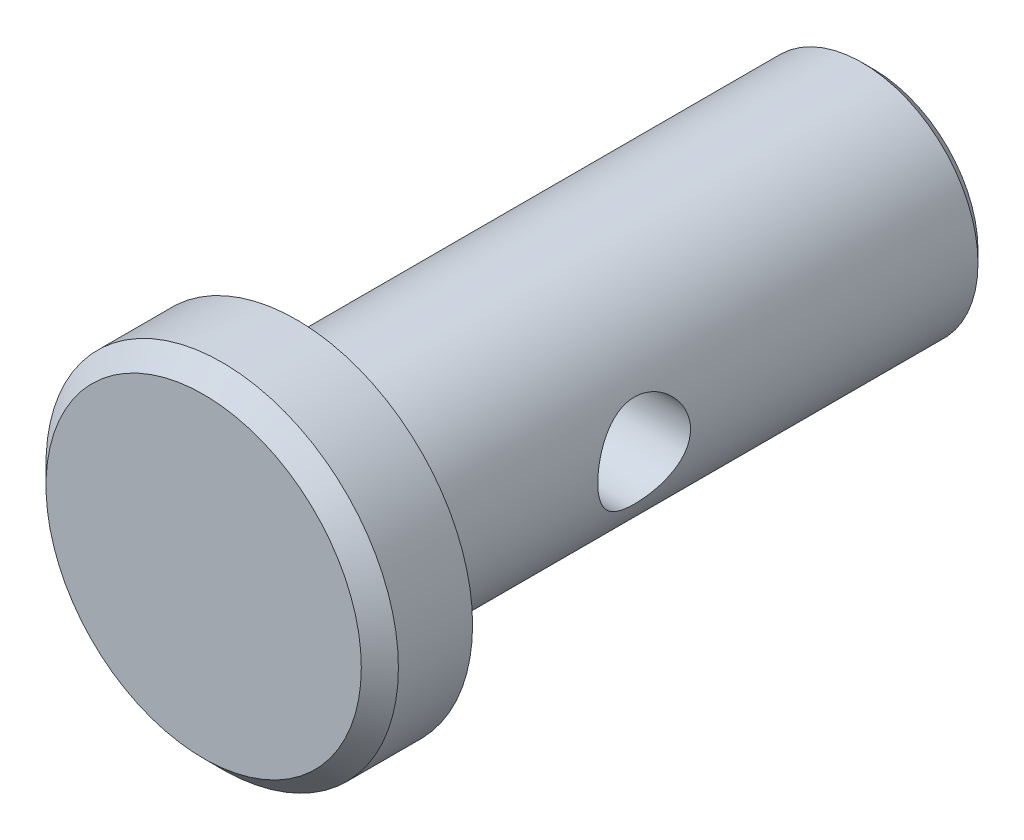
ISO-10303-21;
HEADER;
FILE_DESCRIPTION(('STEP AP214'),'2;1');
FILE_NAME('part.step','',(''),(''),'','','');
FILE_SCHEMA(('AUTOMOTIVE_DESIGN { 1 0 10303 214 1 1 1 1 }'));
ENDSEC;
DATA;
#1=APPLICATION_CONTEXT('core data for automotive mechanical design processes');
#2=APPLICATION_PROTOCOL_DEFINITION('international standard','automotive_design',2000,#1);
#3=PRODUCT_CONTEXT('',#1,'mechanical');
#4=PRODUCT('Part','Part','',(#3));
#5=PRODUCT_RELATED_PRODUCT_CATEGORY('part','',(#4));
#6=PRODUCT_DEFINITION_FORMATION('','',#4);
#7=PRODUCT_DEFINITION_CONTEXT('part definition',#1,'design');
#8=PRODUCT_DEFINITION('design','',#6,#7);
#9=PRODUCT_DEFINITION_SHAPE('','',#8);
#10=(LENGTH_UNIT() NAMED_UNIT(*) SI_UNIT(.MILLI.,.METRE.));
#11=(NAMED_UNIT(*) PLANE_ANGLE_UNIT() SI_UNIT($,.RADIAN.));
#12=(NAMED_UNIT(*) SI_UNIT($,.STERADIAN.) SOLID_ANGLE_UNIT());
#13=UNCERTAINTY_MEASURE_WITH_UNIT(LENGTH_MEASURE(1.E-05),#10,'distance_accuracy_value','');
#14=(GEOMETRIC_REPRESENTATION_CONTEXT(3) GLOBAL_UNCERTAINTY_ASSIGNED_CONTEXT((#13)) GLOBAL_UNIT_ASSIGNED_CONTEXT((#10,
#11,#12)) REPRESENTATION_CONTEXT('',''));
#15=CARTESIAN_POINT('',(0.,0.,0.));
#16=DIRECTION('',(0.,0.,1.));
#17=DIRECTION('',(1.,0.,0.));
#18=AXIS2_PLACEMENT_3D('',#15,#16,#17);
#19=CARTESIAN_POINT('',(0.,0.,-1.524));
#20=DIRECTION('',(0.,0.,1.));
#21=DIRECTION('',(1.,0.,0.));
#22=AXIS2_PLACEMENT_3D('',#19,#20,#21);
#23=CYLINDRICAL_SURFACE('',#22,3.175);
#24=CARTESIAN_POINT('',(0.,0.,-1.20649999999999));
#25=DIRECTION('',(0.,0.,1.));
#26=DIRECTION('',(1.,0.,0.));
#27=AXIS2_PLACEMENT_3D('',#24,#25,#26);
#28=CIRCLE('',#27,3.175);
#29=CARTESIAN_POINT('',(3.175,0.,-1.20649999999999));
#30=VERTEX_POINT('',#29);
#31=EDGE_CURVE('E50',#30,#30,#28,.T.);
#32=ORIENTED_EDGE('',*,*,#31,.T.);
#33=EDGE_LOOP('',(#32));
#34=FACE_BOUND('',#33,.T.);
#35=CARTESIAN_POINT('',(0.,0.,14.2875));
#36=DIRECTION('',(0.,0.,1.));
#37=DIRECTION('',(1.,0.,0.));
#38=AXIS2_PLACEMENT_3D('',#35,#36,#37);
#39=CIRCLE('',#38,3.175);
#40=CARTESIAN_POINT('',(3.175,0.,14.2875));
#41=VERTEX_POINT('',#40);
#42=EDGE_CURVE('E95',#41,#41,#39,.T.);
#43=ORIENTED_EDGE('',*,*,#42,.F.);
#44=EDGE_LOOP('',(#43));
#45=FACE_BOUND('',#44,.T.);
#46=CARTESIAN_POINT('',(-3.175,0.,9.2075));
#47=CARTESIAN_POINT('',(-3.17499537229199,-0.068258058456236,9.20749374409193));
#48=CARTESIAN_POINT('',(-3.17277301884902,-0.136634578197578,9.20196422742388));
#49=CARTESIAN_POINT('',(-3.16409992718907,-0.271460265065364,9.18003770826401));
#50=CARTESIAN_POINT('',(-3.15763769473787,-0.337903678751393,9.16361116278031));
#51=CARTESIAN_POINT('',(-3.1411812285033,-0.466695740931901,9.12058369043264));
#52=CARTESIAN_POINT('',(-3.13119856591186,-0.529057020126769,9.09401607265238));
#53=CARTESIAN_POINT('',(-3.1086844785551,-0.648380701158513,9.03159282493764));
#54=CARTESIAN_POINT('',(-3.09615393885866,-0.70534496773688,8.99574041912648));
#55=CARTESIAN_POINT('',(-3.06915112718216,-0.8150231398072,8.91398045841381));
#56=CARTESIAN_POINT('',(-3.05461858550036,-0.867449543069386,8.86770727328743));
#57=CARTESIAN_POINT('',(-3.02552466335433,-0.964041128038299,8.76719099779225));
#58=CARTESIAN_POINT('',(-3.01096327228158,-1.00820226802979,8.71294403127055));
#59=CARTESIAN_POINT('',(-2.98273972791182,-1.08894535023098,8.59508817539616));
#60=CARTESIAN_POINT('',(-2.96914643637744,-1.12510251305913,8.53117008137527));
#61=CARTESIAN_POINT('',(-2.94534365963613,-1.18602424658859,8.39753438700327));
#62=CARTESIAN_POINT('',(-2.93513256790052,-1.2107942283215,8.32781955981629));
#63=CARTESIAN_POINT('',(-2.9198973711462,-1.24707575285638,8.18787266816902));
#64=CARTESIAN_POINT('',(-2.91465901925809,-1.25913766828659,8.11780746540911));
#65=CARTESIAN_POINT('',(-2.90934142571206,-1.27137983064142,7.97646677607489));
#66=CARTESIAN_POINT('',(-2.90925964706958,-1.2715659203589,7.90519190191312));
#67=CARTESIAN_POINT('',(-2.91408167677796,-1.26046824836539,7.76874451362414));
#68=CARTESIAN_POINT('',(-2.91863891149416,-1.24998182458376,7.70349252135026));
#69=CARTESIAN_POINT('',(-2.93164379130976,-1.21916626898912,7.57576618193574));
#70=CARTESIAN_POINT('',(-2.94009211524262,-1.19883541970094,7.51329232154995));
#71=CARTESIAN_POINT('',(-2.96011273031217,-1.14852115516993,7.39138867401551));
#72=CARTESIAN_POINT('',(-2.971745258433,-1.11834921257023,7.33204703320027));
#73=CARTESIAN_POINT('',(-2.9968070390758,-1.04934160256496,7.21905095661041));
#74=CARTESIAN_POINT('',(-3.01023696565099,-1.01050268123904,7.16539866802922));
#75=CARTESIAN_POINT('',(-3.03864477831342,-0.921734630653566,7.06093982221073));
#76=CARTESIAN_POINT('',(-3.05366207259856,-0.871180288986354,7.01067385680178));
#77=CARTESIAN_POINT('',(-3.08266988848509,-0.762199661418173,6.9191603564687));
#78=CARTESIAN_POINT('',(-3.09666020522781,-0.703771811487366,6.87791461764446));
#79=CARTESIAN_POINT('',(-3.12238822602988,-0.57916930940471,6.80490292089095));
#80=CARTESIAN_POINT('',(-3.13407596510588,-0.512864412005013,6.77334035143987));
#81=CARTESIAN_POINT('',(-3.15350415988762,-0.37530009108163,6.72200340821543));
#82=CARTESIAN_POINT('',(-3.16124662048613,-0.304043204999543,6.70222304615104));
#83=CARTESIAN_POINT('',(-3.17154648586888,-0.163128888630966,6.67610533240849));
#84=CARTESIAN_POINT('',(-3.17438370604281,-0.0936264916808149,6.66904149154899));
#85=CARTESIAN_POINT('',(-3.17543483854251,0.0456217717279636,6.66641218116433));
#86=CARTESIAN_POINT('',(-3.17364994924755,0.115367570397191,6.67084373121733));
#87=CARTESIAN_POINT('',(-3.16584055085483,0.249829789342462,6.69054526287051));
#88=CARTESIAN_POINT('',(-3.16001013504407,0.314631382277426,6.70531931752287));
#89=CARTESIAN_POINT('',(-3.14489745292492,0.440775996818595,6.74461167477673));
#90=CARTESIAN_POINT('',(-3.13561474321397,0.502118572992776,6.76913122908961));
#91=CARTESIAN_POINT('',(-3.11414537679465,0.621715028993606,6.82801843669677));
#92=CARTESIAN_POINT('',(-3.10187858147175,0.679817044449683,6.8626643747474));
#93=CARTESIAN_POINT('',(-3.07577086613408,0.789586680441563,6.94051210568008));
#94=CARTESIAN_POINT('',(-3.06192931625022,0.841251708883315,6.98371732725586));
#95=CARTESIAN_POINT('',(-3.03304649700201,0.9402591323233,7.08080245822301));
#96=CARTESIAN_POINT('',(-3.01798635304908,0.987090947966851,7.13519879885644));
#97=CARTESIAN_POINT('',(-2.98920962302379,1.07108701035771,7.25134445271095));
#98=CARTESIAN_POINT('',(-2.97549325859334,1.10824966394932,7.31309497521587));
#99=CARTESIAN_POINT('',(-2.95093580441395,1.17208776372658,7.44312817606726));
#100=CARTESIAN_POINT('',(-2.9401238561184,1.19865812752938,7.51146833949982));
#101=CARTESIAN_POINT('',(-2.92305532658486,1.23970809951287,7.65221586883912));
#102=CARTESIAN_POINT('',(-2.91679538366959,1.25419663134602,7.72462019069089));
#103=CARTESIAN_POINT('',(-2.91002567155453,1.26981941697178,7.86582621762683));
#104=CARTESIAN_POINT('',(-2.90913452340189,1.27183964726232,7.93451222314178));
#105=CARTESIAN_POINT('',(-2.91220420881017,1.26479500614123,8.07119598464794));
#106=CARTESIAN_POINT('',(-2.91616442626244,1.25573154232525,8.13919382692814));
#107=CARTESIAN_POINT('',(-2.92815422165178,1.22750031750757,8.26981594055795));
#108=CARTESIAN_POINT('',(-2.9360166821043,1.20874630841757,8.33254637426496));
#109=CARTESIAN_POINT('',(-2.95480740782762,1.16205345979179,8.45399542980456));
#110=CARTESIAN_POINT('',(-2.96573651965814,1.13411208368507,8.51271293828139));
#111=CARTESIAN_POINT('',(-2.99020617098852,1.06798920435243,8.62813210823695));
#112=CARTESIAN_POINT('',(-3.00386040268909,1.02931298782628,8.68452585553286));
#113=CARTESIAN_POINT('',(-3.03189515776371,0.9435414957374,8.79030075642439));
#114=CARTESIAN_POINT('',(-3.04627589910738,0.896443682609507,8.83967978830148));
#115=CARTESIAN_POINT('',(-3.07526415100495,0.791530996483014,8.93330881182239));
#116=CARTESIAN_POINT('',(-3.08982591305988,0.733219260727799,8.97701868988027));
#117=CARTESIAN_POINT('',(-3.1165825826321,0.609536703381471,9.05404402206474));
#118=CARTESIAN_POINT('',(-3.12877638843995,0.544162617887497,9.08735464221686));
#119=CARTESIAN_POINT('',(-3.14921718908072,0.409408669684454,9.14185510664583));
#120=CARTESIAN_POINT('',(-3.15753345539943,0.340126077569507,9.16325912046081));
#121=CARTESIAN_POINT('',(-3.16956634442947,0.198676606888576,9.19393584180596));
#122=CARTESIAN_POINT('',(-3.1732975617973,0.12651963892041,9.20324704733238));
#123=CARTESIAN_POINT('',(-3.17484696185127,0.0361393091607406,9.2071160669212));
#124=CARTESIAN_POINT('',(-3.17500122535427,0.0180738073503817,9.20750165647954));
#125=CARTESIAN_POINT('',(-3.175,0.,9.2075));
#126=B_SPLINE_CURVE_WITH_KNOTS('',3,(#46,#47,#48,#49,#50,#51,#52,#53,#54,#55,#56,#57,#58,#59,
#60,#61,#62,#63,#64,#65,#66,#67,#68,#69,#70,#71,#72,#73,#74,#75,#76,#77,#78,#79,#80,#81,#82,#83,
#84,#85,#86,#87,#88,#89,#90,#91,#92,#93,#94,#95,#96,#97,#98,#99,#100,#101,#102,#103,#104,#105,
#106,#107,#108,#109,#110,#111,#112,#113,#114,#115,#116,#117,#118,#119,#120,#121,#122,#123,#124,
#125),.UNSPECIFIED.,.T.,.F.,(4,2,2,2,2,2,2,2,2,2,2,2,2,2,2,2,2,2,2,2,2,2,2,2,2,2,2,2,2,2,2,2,2,
2,2,2,2,2,2,4),(0.,0.2047258973121,0.410009108865038,0.614623775494454,0.8191674851567,
1.03249337379752,1.24592330783351,1.46885189350203,1.691674436801,1.90439106871106,
2.1170030452621,2.31481838534871,2.5126682490759,2.71455595199748,2.91651957930746,
3.13409551733464,3.3517147395323,3.57363339858382,3.79543917132257,4.00411432175285,
4.21273537417002,4.41198289283372,4.61125601111061,4.81662431007897,5.02207504281845,
5.24108981386503,5.4601406484278,5.68131353664426,5.90232292130168,6.10742792604395,
6.31250688577534,6.50947592278469,6.70649938736278,6.91480372216,7.1231709285623,
7.34504768943986,7.56702743411739,7.78487331143458,8.00202395276757,8.05623259144465),.UNSPECIFIED.);
#127=CARTESIAN_POINT('',(-3.175,0.,9.2075));
#128=VERTEX_POINT('',#127);
#129=EDGE_CURVE('E42',#128,#128,#126,.T.);
#130=ORIENTED_EDGE('',*,*,#129,.T.);
#131=EDGE_LOOP('',(#130));
#132=FACE_BOUND('',#131,.T.);
#133=CARTESIAN_POINT('',(3.175,0.,9.2075));
#134=CARTESIAN_POINT('',(3.17499537229199,0.0682580584562361,9.20749374409193));
#135=CARTESIAN_POINT('',(3.17277301884902,0.136634578197578,9.20196422742388));
#136=CARTESIAN_POINT('',(3.16409992718907,0.271460265065364,9.18003770826401));
#137=CARTESIAN_POINT('',(3.15763769473787,0.337903678751393,9.16361116278031));
#138=CARTESIAN_POINT('',(3.1411812285033,0.466695740931902,9.12058369043264));
#139=CARTESIAN_POINT('',(3.13119856591186,0.52905702012677,9.09401607265238));
#140=CARTESIAN_POINT('',(3.10868447855509,0.648380701158514,9.03159282493764));
#141=CARTESIAN_POINT('',(3.09615393885866,0.70534496773688,8.99574041912648));
#142=CARTESIAN_POINT('',(3.06915112718216,0.8150231398072,8.91398045841381));
#143=CARTESIAN_POINT('',(3.05461858550036,0.867449543069386,8.86770727328743));
#144=CARTESIAN_POINT('',(3.02552466335433,0.964041128038299,8.76719099779225));
#145=CARTESIAN_POINT('',(3.01096327228158,1.00820226802979,8.71294403127055));
#146=CARTESIAN_POINT('',(2.98273972791182,1.08894535023098,8.59508817539616));
#147=CARTESIAN_POINT('',(2.96914643637744,1.12510251305913,8.53117008137527));
#148=CARTESIAN_POINT('',(2.94534365963613,1.18602424658859,8.39753438700327));
#149=CARTESIAN_POINT('',(2.93513256790052,1.21079422832151,8.32781955981629));
#150=CARTESIAN_POINT('',(2.9198973711462,1.24707575285638,8.18787266816901));
#151=CARTESIAN_POINT('',(2.91465901925809,1.25913766828659,8.1178074654091));
#152=CARTESIAN_POINT('',(2.90934142571206,1.27137983064142,7.97646677607488));
#153=CARTESIAN_POINT('',(2.90925964706958,1.2715659203589,7.90519190191311));
#154=CARTESIAN_POINT('',(2.91408167677796,1.26046824836539,7.76874451362414));
#155=CARTESIAN_POINT('',(2.91863891149416,1.24998182458376,7.70349252135026));
#156=CARTESIAN_POINT('',(2.93164379130976,1.21916626898912,7.57576618193574));
#157=CARTESIAN_POINT('',(2.94009211524262,1.19883541970094,7.51329232154995));
#158=CARTESIAN_POINT('',(2.96011273031217,1.14852115516993,7.39138867401551));
#159=CARTESIAN_POINT('',(2.971745258433,1.11834921257023,7.33204703320027));
#160=CARTESIAN_POINT('',(2.9968070390758,1.04934160256496,7.21905095661041));
#161=CARTESIAN_POINT('',(3.01023696565099,1.01050268123904,7.16539866802922));
#162=CARTESIAN_POINT('',(3.03864477831342,0.921734630653565,7.06093982221073));
#163=CARTESIAN_POINT('',(3.05366207259856,0.871180288986353,7.01067385680178));
#164=CARTESIAN_POINT('',(3.08266988848509,0.762199661418172,6.9191603564687));
#165=CARTESIAN_POINT('',(3.09666020522781,0.703771811487365,6.87791461764446));
#166=CARTESIAN_POINT('',(3.12238822602988,0.57916930940471,6.80490292089095));
#167=CARTESIAN_POINT('',(3.13407596510588,0.512864412005013,6.77334035143987));
#168=CARTESIAN_POINT('',(3.15350415988762,0.37530009108163,6.72200340821543));
#169=CARTESIAN_POINT('',(3.16124662048613,0.304043204999543,6.70222304615104));
#170=CARTESIAN_POINT('',(3.17154648586888,0.163128888630965,6.67610533240849));
#171=CARTESIAN_POINT('',(3.17438370604281,0.0936264916808141,6.66904149154899));
#172=CARTESIAN_POINT('',(3.17543483854251,-0.0456217717279645,6.66641218116433));
#173=CARTESIAN_POINT('',(3.17364994924755,-0.115367570397192,6.67084373121733));
#174=CARTESIAN_POINT('',(3.16584055085483,-0.249829789342463,6.69054526287051));
#175=CARTESIAN_POINT('',(3.16001013504407,-0.314631382277427,6.70531931752287));
#176=CARTESIAN_POINT('',(3.14489745292492,-0.440775996818596,6.74461167477673));
#177=CARTESIAN_POINT('',(3.13561474321397,-0.502118572992777,6.76913122908961));
#178=CARTESIAN_POINT('',(3.11414537679465,-0.621715028993606,6.82801843669677));
#179=CARTESIAN_POINT('',(3.10187858147175,-0.679817044449683,6.8626643747474));
#180=CARTESIAN_POINT('',(3.07577086613408,-0.789586680441563,6.94051210568008));
#181=CARTESIAN_POINT('',(3.06192931625022,-0.841251708883315,6.98371732725586));
#182=CARTESIAN_POINT('',(3.03304649700201,-0.9402591323233,7.08080245822301));
#183=CARTESIAN_POINT('',(3.01798635304908,-0.987090947966851,7.13519879885644));
#184=CARTESIAN_POINT('',(2.98920962302379,-1.07108701035771,7.25134445271095));
#185=CARTESIAN_POINT('',(2.97549325859334,-1.10824966394932,7.31309497521587));
#186=CARTESIAN_POINT('',(2.95093580441395,-1.17208776372658,7.44312817606726));
#187=CARTESIAN_POINT('',(2.9401238561184,-1.19865812752938,7.51146833949982));
#188=CARTESIAN_POINT('',(2.92305532658486,-1.23970809951287,7.65221586883912));
#189=CARTESIAN_POINT('',(2.91679538366959,-1.25419663134602,7.72462019069089));
#190=CARTESIAN_POINT('',(2.91002567155453,-1.26981941697179,7.86582621762684));
#191=CARTESIAN_POINT('',(2.90913452340189,-1.27183964726232,7.93451222314178));
#192=CARTESIAN_POINT('',(2.91220420881017,-1.26479500614123,8.07119598464794));
#193=CARTESIAN_POINT('',(2.91616442626244,-1.25573154232525,8.13919382692814));
#194=CARTESIAN_POINT('',(2.92815422165178,-1.22750031750757,8.26981594055795));
#195=CARTESIAN_POINT('',(2.9360166821043,-1.20874630841757,8.33254637426496));
#196=CARTESIAN_POINT('',(2.95480740782762,-1.16205345979179,8.45399542980456));
#197=CARTESIAN_POINT('',(2.96573651965814,-1.13411208368507,8.51271293828139));
#198=CARTESIAN_POINT('',(2.99020617098852,-1.06798920435243,8.62813210823695));
#199=CARTESIAN_POINT('',(3.00386040268909,-1.02931298782628,8.68452585553286));
#200=CARTESIAN_POINT('',(3.03189515776371,-0.943541495737399,8.79030075642439));
#201=CARTESIAN_POINT('',(3.04627589910738,-0.896443682609506,8.83967978830148));
#202=CARTESIAN_POINT('',(3.07526415100495,-0.791530996483013,8.9333088118224));
#203=CARTESIAN_POINT('',(3.08982591305988,-0.733219260727798,8.97701868988027));
#204=CARTESIAN_POINT('',(3.1165825826321,-0.60953670338147,9.05404402206474));
#205=CARTESIAN_POINT('',(3.12877638843996,-0.544162617887496,9.08735464221686));
#206=CARTESIAN_POINT('',(3.14921718908072,-0.409408669684454,9.14185510664583));
#207=CARTESIAN_POINT('',(3.15753345539943,-0.340126077569507,9.16325912046081));
#208=CARTESIAN_POINT('',(3.16956634442947,-0.198676606888575,9.19393584180596));
#209=CARTESIAN_POINT('',(3.1732975617973,-0.126519638920409,9.20324704733238));
#210=CARTESIAN_POINT('',(3.17484696185127,-0.0361393091607402,9.2071160669212));
#211=CARTESIAN_POINT('',(3.17500122535427,-0.0180738073503815,9.20750165647954));
#212=CARTESIAN_POINT('',(3.175,0.,9.2075));
#213=B_SPLINE_CURVE_WITH_KNOTS('',3,(#133,#134,#135,#136,#137,#138,#139,#140,#141,#142,#143,
#144,#145,#146,#147,#148,#149,#150,#151,#152,#153,#154,#155,#156,#157,#158,#159,#160,#161,#162,
#163,#164,#165,#166,#167,#168,#169,#170,#171,#172,#173,#174,#175,#176,#177,#178,#179,#180,#181,
#182,#183,#184,#185,#186,#187,#188,#189,#190,#191,#192,#193,#194,#195,#196,#197,#198,#199,#200,
#201,#202,#203,#204,#205,#206,#207,#208,#209,#210,#211,#212),.UNSPECIFIED.,.T.,.F.,(4,2,2,2,2,2,
2,2,2,2,2,2,2,2,2,2,2,2,2,2,2,2,2,2,2,2,2,2,2,2,2,2,2,2,2,2,2,2,2,4),(0.,0.2047258973121,
0.410009108865039,0.614623775494455,0.8191674851567,1.03249337379752,1.24592330783351,
1.46885189350203,1.691674436801,1.90439106871106,2.1170030452621,2.31481838534871,
2.5126682490759,2.71455595199748,2.91651957930746,3.13409551733464,3.3517147395323,
3.57363339858382,3.79543917132257,4.00411432175285,4.21273537417002,4.41198289283372,
4.61125601111061,4.81662431007897,5.02207504281845,5.24108981386503,5.4601406484278,
5.68131353664426,5.90232292130168,6.10742792604395,6.31250688577534,6.50947592278469,
6.70649938736278,6.91480372216,7.1231709285623,7.34504768943986,7.56702743411739,
7.78487331143458,8.00202395276758,8.05623259144465),.UNSPECIFIED.);
#214=CARTESIAN_POINT('',(3.175,0.,9.2075));
#215=VERTEX_POINT('',#214);
#216=EDGE_CURVE('E10',#215,#215,#213,.T.);
#217=ORIENTED_EDGE('',*,*,#216,.T.);
#218=EDGE_LOOP('',(#217));
#219=FACE_BOUND('',#218,.T.);
#220=ADVANCED_FACE('F31',(#34,#45,#132,#219),#23,.T.);
#221=CARTESIAN_POINT('',(0.,0.,-1.524));
#222=DIRECTION('',(0.,0.,1.));
#223=DIRECTION('',(1.,0.,0.));
#224=AXIS2_PLACEMENT_3D('',#221,#222,#223);
#225=PLANE('',#224);
#226=CARTESIAN_POINT('',(0.,0.,-1.524));
#227=DIRECTION('',(0.,0.,1.));
#228=DIRECTION('',(1.,0.,0.));
#229=AXIS2_PLACEMENT_3D('',#226,#227,#228);
#230=CIRCLE('',#229,2.85749999999999);
#231=CARTESIAN_POINT('',(2.85749999999999,0.,-1.524));
#232=VERTEX_POINT('',#231);
#233=EDGE_CURVE('E46',#232,#232,#230,.F.);
#234=ORIENTED_EDGE('',*,*,#233,.T.);
#235=EDGE_LOOP('',(#234));
#236=FACE_BOUND('',#235,.T.);
#237=ADVANCED_FACE('F74',(#236),#225,.F.);
#238=CARTESIAN_POINT('',(0.,0.,16.8275));
#239=DIRECTION('',(0.,0.,-1.));
#240=DIRECTION('',(-1.,0.,0.));
#241=AXIS2_PLACEMENT_3D('',#238,#239,#240);
#242=CYLINDRICAL_SURFACE('',#241,4.826);
#243=CARTESIAN_POINT('',(0.,0.,16.3195));
#244=DIRECTION('',(0.,0.,1.));
#245=DIRECTION('',(1.,0.,0.));
#246=AXIS2_PLACEMENT_3D('',#243,#244,#245);
#247=CIRCLE('',#246,4.826);
#248=CARTESIAN_POINT('',(4.826,0.,16.3195));
#249=VERTEX_POINT('',#248);
#250=EDGE_CURVE('E88',#249,#249,#247,.F.);
#251=ORIENTED_EDGE('',*,*,#250,.T.);
#252=EDGE_LOOP('',(#251));
#253=FACE_BOUND('',#252,.T.);
#254=CARTESIAN_POINT('',(0.,0.,14.2875));
#255=DIRECTION('',(0.,0.,1.));
#256=DIRECTION('',(1.,0.,0.));
#257=AXIS2_PLACEMENT_3D('',#254,#255,#256);
#258=CIRCLE('',#257,4.826);
#259=CARTESIAN_POINT('',(4.826,0.,14.2875));
#260=VERTEX_POINT('',#259);
#261=EDGE_CURVE('E98',#260,#260,#258,.T.);
#262=ORIENTED_EDGE('',*,*,#261,.T.);
#263=EDGE_LOOP('',(#262));
#264=FACE_BOUND('',#263,.T.);
#265=ADVANCED_FACE('F67',(#253,#264),#242,.T.);
#266=CARTESIAN_POINT('',(0.,0.,16.8275));
#267=DIRECTION('',(0.,0.,1.));
#268=DIRECTION('',(1.,0.,0.));
#269=AXIS2_PLACEMENT_3D('',#266,#267,#268);
#270=PLANE('',#269);
#271=CARTESIAN_POINT('',(0.,0.,16.8275));
#272=DIRECTION('',(0.,0.,1.));
#273=DIRECTION('',(1.,0.,0.));
#274=AXIS2_PLACEMENT_3D('',#271,#272,#273);
#275=CIRCLE('',#274,4.318);
#276=CARTESIAN_POINT('',(4.318,0.,16.8275));
#277=VERTEX_POINT('',#276);
#278=EDGE_CURVE('E90',#277,#277,#275,.T.);
#279=ORIENTED_EDGE('',*,*,#278,.T.);
#280=EDGE_LOOP('',(#279));
#281=FACE_BOUND('',#280,.T.);
#282=ADVANCED_FACE('F62',(#281),#270,.T.);
#283=CARTESIAN_POINT('',(0.,0.,14.2875));
#284=DIRECTION('',(0.,0.,1.));
#285=DIRECTION('',(1.,0.,0.));
#286=AXIS2_PLACEMENT_3D('',#283,#284,#285);
#287=PLANE('',#286);
#288=ORIENTED_EDGE('',*,*,#42,.T.);
#289=EDGE_LOOP('',(#288));
#290=FACE_BOUND('',#289,.T.);
#291=ORIENTED_EDGE('',*,*,#261,.F.);
#292=EDGE_LOOP('',(#291));
#293=FACE_BOUND('',#292,.T.);
#294=ADVANCED_FACE('F66',(#290,#293),#287,.F.);
#295=CARTESIAN_POINT('',(0.,0.,16.8275));
#296=DIRECTION('',(0.,0.,-1.));
#297=DIRECTION('',(-1.,0.,0.));
#298=AXIS2_PLACEMENT_3D('',#295,#296,#297);
#299=CONICAL_SURFACE('',#298,4.318,0.785398163397451);
#300=ORIENTED_EDGE('',*,*,#250,.F.);
#301=EDGE_LOOP('',(#300));
#302=FACE_BOUND('',#301,.T.);
#303=ORIENTED_EDGE('',*,*,#278,.F.);
#304=EDGE_LOOP('',(#303));
#305=FACE_BOUND('',#304,.T.);
#306=ADVANCED_FACE('F71',(#302,#305),#299,.T.);
#307=CARTESIAN_POINT('',(0.,0.,-1.20649999999999));
#308=DIRECTION('',(0.,0.,1.));
#309=DIRECTION('',(1.,0.,0.));
#310=AXIS2_PLACEMENT_3D('',#307,#308,#309);
#311=CONICAL_SURFACE('',#310,3.175,0.785398163397452);
#312=ORIENTED_EDGE('',*,*,#233,.F.);
#313=EDGE_LOOP('',(#312));
#314=FACE_BOUND('',#313,.T.);
#315=ORIENTED_EDGE('',*,*,#31,.F.);
#316=EDGE_LOOP('',(#315));
#317=FACE_BOUND('',#316,.T.);
#318=ADVANCED_FACE('F33',(#314,#317),#311,.T.);
#319=CARTESIAN_POINT('',(3.175,0.,7.9375));
#320=DIRECTION('',(-1.,0.,0.));
#321=DIRECTION('',(0.,0.,1.));
#322=AXIS2_PLACEMENT_3D('',#319,#320,#321);
#323=CYLINDRICAL_SURFACE('',#322,1.27);
#324=ORIENTED_EDGE('',*,*,#216,.F.);
#325=EDGE_LOOP('',(#324));
#326=FACE_BOUND('',#325,.T.);
#327=ORIENTED_EDGE('',*,*,#129,.F.);
#328=EDGE_LOOP('',(#327));
#329=FACE_BOUND('',#328,.T.);
#330=ADVANCED_FACE('F57',(#326,#329),#323,.F.);
#331=CLOSED_SHELL('',(#220,#237,#265,#282,#294,#306,#318,#330));
#332=MANIFOLD_SOLID_BREP('B2',#331);
#333=ADVANCED_BREP_SHAPE_REPRESENTATION('',(#18,#332),#14);
#334=SHAPE_DEFINITION_REPRESENTATION(#9,#333);
ENDSEC;
END-ISO-10303-21;
